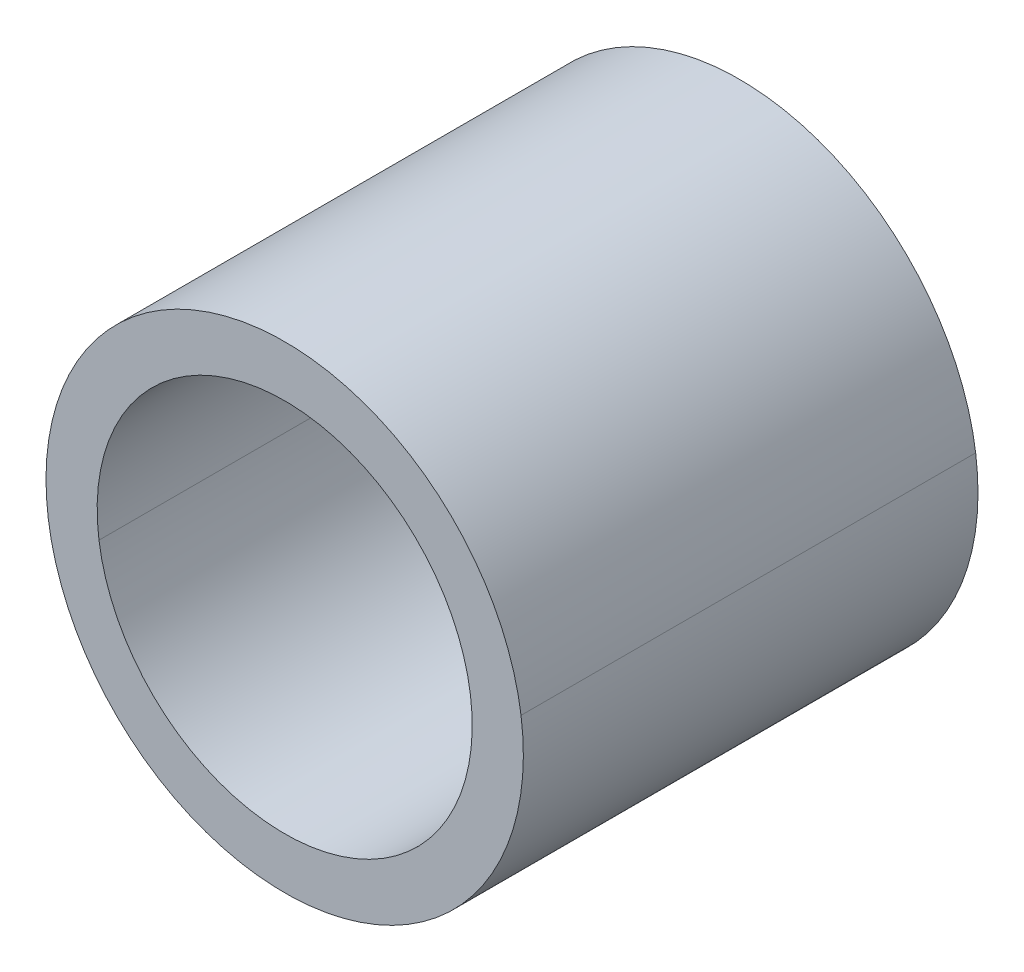
ISO-10303-21;
HEADER;
FILE_DESCRIPTION(('STEP AP214'),'2;1');
FILE_NAME('part.step','',(''),(''),'','','');
FILE_SCHEMA(('AUTOMOTIVE_DESIGN { 1 0 10303 214 1 1 1 1 }'));
ENDSEC;
DATA;
#1=APPLICATION_CONTEXT('core data for automotive mechanical design processes');
#2=APPLICATION_PROTOCOL_DEFINITION('international standard','automotive_design',2000,#1);
#3=PRODUCT_CONTEXT('',#1,'mechanical');
#4=PRODUCT('Part','Part','',(#3));
#5=PRODUCT_RELATED_PRODUCT_CATEGORY('part','',(#4));
#6=PRODUCT_DEFINITION_FORMATION('','',#4);
#7=PRODUCT_DEFINITION_CONTEXT('part definition',#1,'design');
#8=PRODUCT_DEFINITION('design','',#6,#7);
#9=PRODUCT_DEFINITION_SHAPE('','',#8);
#10=(LENGTH_UNIT() NAMED_UNIT(*) SI_UNIT(.MILLI.,.METRE.));
#11=(NAMED_UNIT(*) PLANE_ANGLE_UNIT() SI_UNIT($,.RADIAN.));
#12=(NAMED_UNIT(*) SI_UNIT($,.STERADIAN.) SOLID_ANGLE_UNIT());
#13=UNCERTAINTY_MEASURE_WITH_UNIT(LENGTH_MEASURE(1.E-05),#10,'distance_accuracy_value','');
#14=(GEOMETRIC_REPRESENTATION_CONTEXT(3) GLOBAL_UNCERTAINTY_ASSIGNED_CONTEXT((#13)) GLOBAL_UNIT_ASSIGNED_CONTEXT((#10,
#11,#12)) REPRESENTATION_CONTEXT('',''));
#15=CARTESIAN_POINT('',(0.,0.,0.));
#16=DIRECTION('',(0.,0.,1.));
#17=DIRECTION('',(1.,0.,0.));
#18=AXIS2_PLACEMENT_3D('',#15,#16,#17);
#19=CARTESIAN_POINT('',(3.81913118098169,-6.67633983696849,-18.3));
#20=DIRECTION('',(0.,0.,-1.));
#21=DIRECTION('',(0.990268068741566,0.139173100960096,0.));
#22=AXIS2_PLACEMENT_3D('',#19,#20,#21);
#23=CYLINDRICAL_SURFACE('',#22,0.825);
#24=DIRECTION('',(0.,0.,-1.));
#25=VECTOR('',#24,1.);
#26=CARTESIAN_POINT('',(4.63610233769348,-6.56152202867641,-15.8));
#27=LINE('',#26,#25);
#28=CARTESIAN_POINT('',(4.63610233769348,-6.56152202867641,-15.8));
#29=VERTEX_POINT('',#28);
#30=CARTESIAN_POINT('',(4.63610233769348,-6.56152202867641,-17.8));
#31=VERTEX_POINT('',#30);
#32=EDGE_CURVE('E11',#29,#31,#27,.T.);
#33=ORIENTED_EDGE('',*,*,#32,.T.);
#34=CARTESIAN_POINT('',(3.81913118098169,-6.67633983696849,-17.8));
#35=DIRECTION('',(0.,0.,1.));
#36=DIRECTION('',(-0.990268068741566,-0.139173100960096,0.));
#37=AXIS2_PLACEMENT_3D('',#34,#35,#36);
#38=CIRCLE('',#37,0.825);
#39=CARTESIAN_POINT('',(3.0021600242699,-6.79115764526057,-17.8));
#40=VERTEX_POINT('',#39);
#41=EDGE_CURVE('E69',#40,#31,#38,.T.);
#42=ORIENTED_EDGE('',*,*,#41,.F.);
#43=DIRECTION('',(0.,0.,-1.));
#44=VECTOR('',#43,1.);
#45=CARTESIAN_POINT('',(3.0021600242699,-6.79115764526057,-15.8));
#46=LINE('',#45,#44);
#47=CARTESIAN_POINT('',(3.0021600242699,-6.79115764526057,-15.8));
#48=VERTEX_POINT('',#47);
#49=EDGE_CURVE('E21',#48,#40,#46,.T.);
#50=ORIENTED_EDGE('',*,*,#49,.F.);
#51=CARTESIAN_POINT('',(3.81913118098169,-6.67633983696849,-15.8));
#52=DIRECTION('',(0.,0.,-1.));
#53=DIRECTION('',(0.990268068741566,0.139173100960096,0.));
#54=AXIS2_PLACEMENT_3D('',#51,#52,#53);
#55=CIRCLE('',#54,0.825);
#56=EDGE_CURVE('E66',#29,#48,#55,.T.);
#57=ORIENTED_EDGE('',*,*,#56,.F.);
#58=EDGE_LOOP('',(#33,#42,#50,#57));
#59=FACE_BOUND('',#58,.T.);
#60=ADVANCED_FACE('F17',(#59),#23,.F.);
#61=CARTESIAN_POINT('',(3.81913118098169,-6.67633983696849,-18.3));
#62=DIRECTION('',(0.,0.,-1.));
#63=DIRECTION('',(0.990268068741566,0.139173100960096,0.));
#64=AXIS2_PLACEMENT_3D('',#61,#62,#63);
#65=CYLINDRICAL_SURFACE('',#64,0.825);
#66=ORIENTED_EDGE('',*,*,#49,.T.);
#67=CARTESIAN_POINT('',(3.81913118098169,-6.67633983696849,-17.8));
#68=DIRECTION('',(0.,0.,1.));
#69=DIRECTION('',(0.990268068741566,0.139173100960096,0.));
#70=AXIS2_PLACEMENT_3D('',#67,#68,#69);
#71=CIRCLE('',#70,0.825);
#72=EDGE_CURVE('E71',#31,#40,#71,.T.);
#73=ORIENTED_EDGE('',*,*,#72,.F.);
#74=ORIENTED_EDGE('',*,*,#32,.F.);
#75=CARTESIAN_POINT('',(3.81913118098169,-6.67633983696849,-15.8));
#76=DIRECTION('',(0.,0.,-1.));
#77=DIRECTION('',(-0.990268068741566,-0.139173100960096,0.));
#78=AXIS2_PLACEMENT_3D('',#75,#76,#77);
#79=CIRCLE('',#78,0.825);
#80=EDGE_CURVE('E75',#48,#29,#79,.T.);
#81=ORIENTED_EDGE('',*,*,#80,.F.);
#82=EDGE_LOOP('',(#66,#73,#74,#81));
#83=FACE_BOUND('',#82,.T.);
#84=ADVANCED_FACE('F19',(#83),#65,.F.);
#85=CARTESIAN_POINT('',(3.81913118098169,-6.67633983696849,-17.8));
#86=DIRECTION('',(0.,0.,1.));
#87=DIRECTION('',(1.,0.,0.));
#88=AXIS2_PLACEMENT_3D('',#85,#86,#87);
#89=PLANE('',#88);
#90=ORIENTED_EDGE('',*,*,#41,.T.);
#91=ORIENTED_EDGE('',*,*,#72,.T.);
#92=EDGE_LOOP('',(#90,#91));
#93=FACE_BOUND('',#92,.T.);
#94=CARTESIAN_POINT('',(3.81913118098169,-6.67633983696849,-17.8));
#95=DIRECTION('',(0.,0.,-1.));
#96=DIRECTION('',(-0.990268068741566,-0.139173100960095,0.));
#97=AXIS2_PLACEMENT_3D('',#94,#95,#96);
#98=CIRCLE('',#97,1.05);
#99=CARTESIAN_POINT('',(2.77934970880304,-6.82247159297659,-17.8));
#100=VERTEX_POINT('',#99);
#101=CARTESIAN_POINT('',(4.85891265316033,-6.53020808096039,-17.8));
#102=VERTEX_POINT('',#101);
#103=EDGE_CURVE('E105',#100,#102,#98,.T.);
#104=ORIENTED_EDGE('',*,*,#103,.T.);
#105=CARTESIAN_POINT('',(3.81913118098169,-6.67633983696849,-17.8));
#106=DIRECTION('',(0.,0.,-1.));
#107=DIRECTION('',(0.990268068741566,0.139173100960095,0.));
#108=AXIS2_PLACEMENT_3D('',#105,#106,#107);
#109=CIRCLE('',#108,1.05);
#110=EDGE_CURVE('E77',#102,#100,#109,.T.);
#111=ORIENTED_EDGE('',*,*,#110,.T.);
#112=EDGE_LOOP('',(#104,#111));
#113=FACE_BOUND('',#112,.T.);
#114=ADVANCED_FACE('F132',(#93,#113),#89,.F.);
#115=CARTESIAN_POINT('',(3.81913118098169,-6.67633983696849,-18.3));
#116=DIRECTION('',(0.,0.,-1.));
#117=DIRECTION('',(0.990268068741566,0.139173100960095,0.));
#118=AXIS2_PLACEMENT_3D('',#115,#116,#117);
#119=CYLINDRICAL_SURFACE('',#118,1.05);
#120=DIRECTION('',(0.,0.,-1.));
#121=VECTOR('',#120,1.);
#122=CARTESIAN_POINT('',(2.77934970880304,-6.82247159297659,-15.8));
#123=LINE('',#122,#121);
#124=CARTESIAN_POINT('',(2.77934970880304,-6.82247159297659,-15.8));
#125=VERTEX_POINT('',#124);
#126=EDGE_CURVE('E107',#125,#100,#123,.T.);
#127=ORIENTED_EDGE('',*,*,#126,.T.);
#128=ORIENTED_EDGE('',*,*,#110,.F.);
#129=DIRECTION('',(0.,0.,-1.));
#130=VECTOR('',#129,1.);
#131=CARTESIAN_POINT('',(4.85891265316033,-6.53020808096039,-15.8));
#132=LINE('',#131,#130);
#133=CARTESIAN_POINT('',(4.85891265316033,-6.53020808096039,-15.8));
#134=VERTEX_POINT('',#133);
#135=EDGE_CURVE('E104',#134,#102,#132,.T.);
#136=ORIENTED_EDGE('',*,*,#135,.F.);
#137=CARTESIAN_POINT('',(3.81913118098169,-6.67633983696849,-15.8));
#138=DIRECTION('',(0.,0.,1.));
#139=DIRECTION('',(-0.990268068741566,-0.139173100960095,0.));
#140=AXIS2_PLACEMENT_3D('',#137,#138,#139);
#141=CIRCLE('',#140,1.05);
#142=EDGE_CURVE('E80',#125,#134,#141,.T.);
#143=ORIENTED_EDGE('',*,*,#142,.F.);
#144=EDGE_LOOP('',(#127,#128,#136,#143));
#145=FACE_BOUND('',#144,.T.);
#146=ADVANCED_FACE('F121',(#145),#119,.T.);
#147=CARTESIAN_POINT('',(3.81913118098169,-6.67633983696849,-15.8));
#148=DIRECTION('',(0.,0.,1.));
#149=DIRECTION('',(1.,0.,0.));
#150=AXIS2_PLACEMENT_3D('',#147,#148,#149);
#151=PLANE('',#150);
#152=ORIENTED_EDGE('',*,*,#80,.T.);
#153=ORIENTED_EDGE('',*,*,#56,.T.);
#154=EDGE_LOOP('',(#152,#153));
#155=FACE_BOUND('',#154,.T.);
#156=ORIENTED_EDGE('',*,*,#142,.T.);
#157=CARTESIAN_POINT('',(3.81913118098169,-6.67633983696849,-15.8));
#158=DIRECTION('',(0.,0.,1.));
#159=DIRECTION('',(0.990268068741566,0.139173100960095,0.));
#160=AXIS2_PLACEMENT_3D('',#157,#158,#159);
#161=CIRCLE('',#160,1.05);
#162=EDGE_CURVE('E86',#134,#125,#161,.T.);
#163=ORIENTED_EDGE('',*,*,#162,.T.);
#164=EDGE_LOOP('',(#156,#163));
#165=FACE_BOUND('',#164,.T.);
#166=ADVANCED_FACE('F73',(#155,#165),#151,.T.);
#167=CARTESIAN_POINT('',(3.81913118098169,-6.67633983696849,-18.3));
#168=DIRECTION('',(0.,0.,-1.));
#169=DIRECTION('',(0.990268068741566,0.139173100960095,0.));
#170=AXIS2_PLACEMENT_3D('',#167,#168,#169);
#171=CYLINDRICAL_SURFACE('',#170,1.05);
#172=ORIENTED_EDGE('',*,*,#135,.T.);
#173=ORIENTED_EDGE('',*,*,#103,.F.);
#174=ORIENTED_EDGE('',*,*,#126,.F.);
#175=ORIENTED_EDGE('',*,*,#162,.F.);
#176=EDGE_LOOP('',(#172,#173,#174,#175));
#177=FACE_BOUND('',#176,.T.);
#178=ADVANCED_FACE('F119',(#177),#171,.T.);
#179=CLOSED_SHELL('',(#60,#84,#114,#146,#166,#178));
#180=MANIFOLD_SOLID_BREP('B1',#179);
#181=ADVANCED_BREP_SHAPE_REPRESENTATION('',(#18,#180),#14);
#182=SHAPE_DEFINITION_REPRESENTATION(#9,#181);
ENDSEC;
END-ISO-10303-21;
